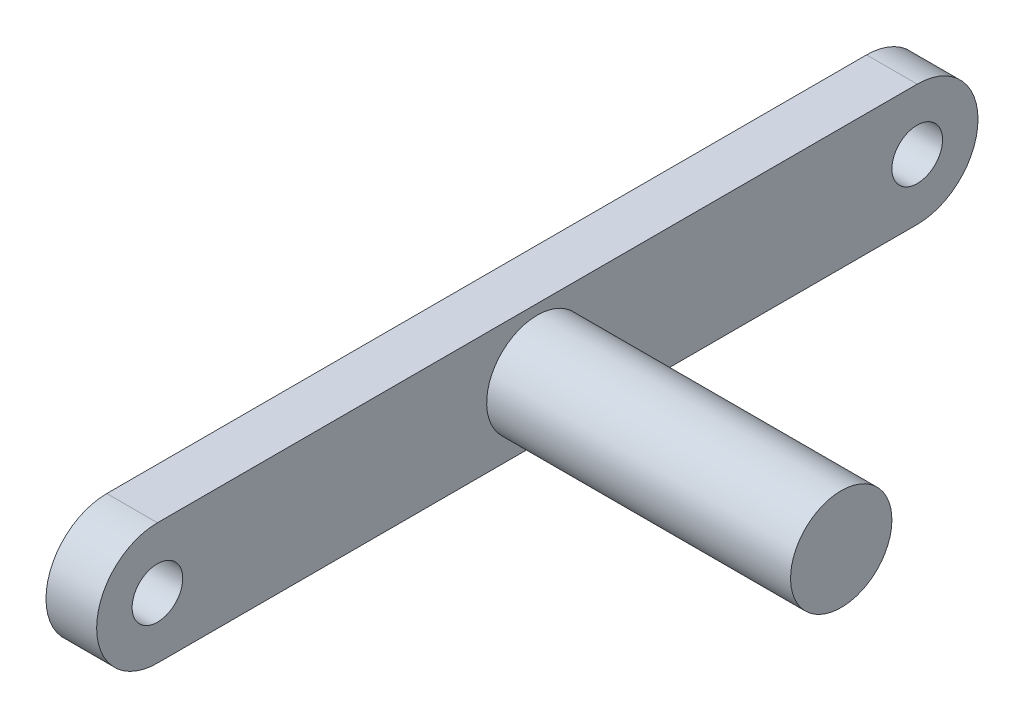
ISO-10303-21;
HEADER;
FILE_DESCRIPTION(('STEP AP214'),'2;1');
FILE_NAME('part.step','',(''),(''),'','','');
FILE_SCHEMA(('AUTOMOTIVE_DESIGN { 1 0 10303 214 1 1 1 1 }'));
ENDSEC;
DATA;
#1=APPLICATION_CONTEXT('core data for automotive mechanical design processes');
#2=APPLICATION_PROTOCOL_DEFINITION('international standard','automotive_design',2000,#1);
#3=PRODUCT_CONTEXT('',#1,'mechanical');
#4=PRODUCT('Part','Part','',(#3));
#5=PRODUCT_RELATED_PRODUCT_CATEGORY('part','',(#4));
#6=PRODUCT_DEFINITION_FORMATION('','',#4);
#7=PRODUCT_DEFINITION_CONTEXT('part definition',#1,'design');
#8=PRODUCT_DEFINITION('design','',#6,#7);
#9=PRODUCT_DEFINITION_SHAPE('','',#8);
#10=(LENGTH_UNIT() NAMED_UNIT(*) SI_UNIT(.MILLI.,.METRE.));
#11=(NAMED_UNIT(*) PLANE_ANGLE_UNIT() SI_UNIT($,.RADIAN.));
#12=(NAMED_UNIT(*) SI_UNIT($,.STERADIAN.) SOLID_ANGLE_UNIT());
#13=UNCERTAINTY_MEASURE_WITH_UNIT(LENGTH_MEASURE(1.E-05),#10,'distance_accuracy_value','');
#14=(GEOMETRIC_REPRESENTATION_CONTEXT(3) GLOBAL_UNCERTAINTY_ASSIGNED_CONTEXT((#13)) GLOBAL_UNIT_ASSIGNED_CONTEXT((#10,
#11,#12)) REPRESENTATION_CONTEXT('',''));
#15=CARTESIAN_POINT('',(0.,0.,0.));
#16=DIRECTION('',(0.,0.,1.));
#17=DIRECTION('',(1.,0.,0.));
#18=AXIS2_PLACEMENT_3D('',#15,#16,#17);
#19=CARTESIAN_POINT('',(30.,0.,0.));
#20=DIRECTION('',(1.,0.,0.));
#21=DIRECTION('',(0.,1.,0.));
#22=AXIS2_PLACEMENT_3D('',#19,#20,#21);
#23=CYLINDRICAL_SURFACE('',#22,5.);
#24=CARTESIAN_POINT('',(0.,0.,0.));
#25=DIRECTION('',(1.,0.,0.));
#26=DIRECTION('',(0.,0.,-1.));
#27=AXIS2_PLACEMENT_3D('',#24,#25,#26);
#28=CIRCLE('',#27,5.);
#29=CARTESIAN_POINT('',(0.,0.,-5.));
#30=VERTEX_POINT('',#29);
#31=EDGE_CURVE('E41',#30,#30,#28,.F.);
#32=ORIENTED_EDGE('',*,*,#31,.F.);
#33=EDGE_LOOP('',(#32));
#34=FACE_BOUND('',#33,.T.);
#35=CARTESIAN_POINT('',(30.,0.,0.));
#36=DIRECTION('',(1.,0.,0.));
#37=DIRECTION('',(0.,1.,0.));
#38=AXIS2_PLACEMENT_3D('',#35,#36,#37);
#39=CIRCLE('',#38,5.);
#40=CARTESIAN_POINT('',(30.,4.99999999999999,0.));
#41=VERTEX_POINT('',#40);
#42=EDGE_CURVE('E11',#41,#41,#39,.T.);
#43=ORIENTED_EDGE('',*,*,#42,.F.);
#44=EDGE_LOOP('',(#43));
#45=FACE_BOUND('',#44,.T.);
#46=ADVANCED_FACE('F33',(#34,#45),#23,.T.);
#47=CARTESIAN_POINT('',(30.,4.99999999999999,0.));
#48=DIRECTION('',(1.,0.,0.));
#49=DIRECTION('',(0.,1.,0.));
#50=AXIS2_PLACEMENT_3D('',#47,#48,#49);
#51=PLANE('',#50);
#52=ORIENTED_EDGE('',*,*,#42,.T.);
#53=EDGE_LOOP('',(#52));
#54=FACE_BOUND('',#53,.T.);
#55=ADVANCED_FACE('F120',(#54),#51,.T.);
#56=CARTESIAN_POINT('',(-5.,0.,37.5));
#57=DIRECTION('',(1.,0.,0.));
#58=DIRECTION('',(0.,0.,-1.));
#59=AXIS2_PLACEMENT_3D('',#56,#57,#58);
#60=CYLINDRICAL_SURFACE('',#59,6.);
#61=CARTESIAN_POINT('',(0.,0.,37.5));
#62=DIRECTION('',(1.,0.,0.));
#63=DIRECTION('',(0.,0.,-1.));
#64=AXIS2_PLACEMENT_3D('',#61,#62,#63);
#65=CIRCLE('',#64,6.);
#66=CARTESIAN_POINT('',(0.,6.,37.5));
#67=VERTEX_POINT('',#66);
#68=CARTESIAN_POINT('',(0.,-6.,37.5));
#69=VERTEX_POINT('',#68);
#70=EDGE_CURVE('E101',#67,#69,#65,.T.);
#71=ORIENTED_EDGE('',*,*,#70,.F.);
#72=DIRECTION('',(1.,0.,0.));
#73=VECTOR('',#72,1.);
#74=CARTESIAN_POINT('',(-5.,6.,37.5));
#75=LINE('',#74,#73);
#76=CARTESIAN_POINT('',(-5.,6.,37.5));
#77=VERTEX_POINT('',#76);
#78=EDGE_CURVE('E49',#77,#67,#75,.T.);
#79=ORIENTED_EDGE('',*,*,#78,.F.);
#80=CARTESIAN_POINT('',(-5.,0.,37.5));
#81=DIRECTION('',(1.,0.,0.));
#82=DIRECTION('',(0.,0.,-1.));
#83=AXIS2_PLACEMENT_3D('',#80,#81,#82);
#84=CIRCLE('',#83,6.);
#85=CARTESIAN_POINT('',(-5.,-6.,37.5));
#86=VERTEX_POINT('',#85);
#87=EDGE_CURVE('E94',#77,#86,#84,.T.);
#88=ORIENTED_EDGE('',*,*,#87,.T.);
#89=DIRECTION('',(1.,0.,0.));
#90=VECTOR('',#89,1.);
#91=CARTESIAN_POINT('',(-5.,-6.,37.5));
#92=LINE('',#91,#90);
#93=EDGE_CURVE('E77',#86,#69,#92,.T.);
#94=ORIENTED_EDGE('',*,*,#93,.T.);
#95=EDGE_LOOP('',(#71,#79,#88,#94));
#96=FACE_BOUND('',#95,.T.);
#97=ADVANCED_FACE('F124',(#96),#60,.T.);
#98=CARTESIAN_POINT('',(-5.,6.,37.5));
#99=DIRECTION('',(0.,1.,0.));
#100=DIRECTION('',(0.,0.,1.));
#101=AXIS2_PLACEMENT_3D('',#98,#99,#100);
#102=PLANE('',#101);
#103=DIRECTION('',(0.,0.,1.));
#104=VECTOR('',#103,1.);
#105=CARTESIAN_POINT('',(0.,6.,37.5));
#106=LINE('',#105,#104);
#107=CARTESIAN_POINT('',(0.,6.00000000000002,-37.5));
#108=VERTEX_POINT('',#107);
#109=EDGE_CURVE('E96',#108,#67,#106,.T.);
#110=ORIENTED_EDGE('',*,*,#109,.F.);
#111=DIRECTION('',(1.,0.,0.));
#112=VECTOR('',#111,1.);
#113=CARTESIAN_POINT('',(-5.,6.00000000000002,-37.5));
#114=LINE('',#113,#112);
#115=CARTESIAN_POINT('',(-5.,6.00000000000002,-37.5));
#116=VERTEX_POINT('',#115);
#117=EDGE_CURVE('E66',#116,#108,#114,.T.);
#118=ORIENTED_EDGE('',*,*,#117,.F.);
#119=DIRECTION('',(0.,0.,1.));
#120=VECTOR('',#119,1.);
#121=CARTESIAN_POINT('',(-5.,6.,37.5));
#122=LINE('',#121,#120);
#123=EDGE_CURVE('E91',#116,#77,#122,.T.);
#124=ORIENTED_EDGE('',*,*,#123,.T.);
#125=ORIENTED_EDGE('',*,*,#78,.T.);
#126=EDGE_LOOP('',(#110,#118,#124,#125));
#127=FACE_BOUND('',#126,.T.);
#128=ADVANCED_FACE('F128',(#127),#102,.T.);
#129=CARTESIAN_POINT('',(-5.,0.,-37.5));
#130=DIRECTION('',(1.,0.,0.));
#131=DIRECTION('',(0.,0.,-1.));
#132=AXIS2_PLACEMENT_3D('',#129,#130,#131);
#133=CYLINDRICAL_SURFACE('',#132,6.);
#134=CARTESIAN_POINT('',(0.,0.,-37.5));
#135=DIRECTION('',(1.,0.,0.));
#136=DIRECTION('',(0.,0.,-1.));
#137=AXIS2_PLACEMENT_3D('',#134,#135,#136);
#138=CIRCLE('',#137,6.);
#139=CARTESIAN_POINT('',(0.,-5.99999999999999,-37.5));
#140=VERTEX_POINT('',#139);
#141=EDGE_CURVE('E85',#140,#108,#138,.T.);
#142=ORIENTED_EDGE('',*,*,#141,.F.);
#143=DIRECTION('',(1.,0.,0.));
#144=VECTOR('',#143,1.);
#145=CARTESIAN_POINT('',(-5.,-5.99999999999999,-37.5));
#146=LINE('',#145,#144);
#147=CARTESIAN_POINT('',(-5.,-5.99999999999999,-37.5));
#148=VERTEX_POINT('',#147);
#149=EDGE_CURVE('E80',#148,#140,#146,.T.);
#150=ORIENTED_EDGE('',*,*,#149,.F.);
#151=CARTESIAN_POINT('',(-5.,0.,-37.5));
#152=DIRECTION('',(1.,0.,0.));
#153=DIRECTION('',(0.,0.,-1.));
#154=AXIS2_PLACEMENT_3D('',#151,#152,#153);
#155=CIRCLE('',#154,6.);
#156=EDGE_CURVE('E83',#148,#116,#155,.T.);
#157=ORIENTED_EDGE('',*,*,#156,.T.);
#158=ORIENTED_EDGE('',*,*,#117,.T.);
#159=EDGE_LOOP('',(#142,#150,#157,#158));
#160=FACE_BOUND('',#159,.T.);
#161=ADVANCED_FACE('F82',(#160),#133,.T.);
#162=CARTESIAN_POINT('',(-5.,-6.,37.5));
#163=DIRECTION('',(0.,-1.,0.));
#164=DIRECTION('',(0.,0.,-1.));
#165=AXIS2_PLACEMENT_3D('',#162,#163,#164);
#166=PLANE('',#165);
#167=DIRECTION('',(0.,0.,-1.));
#168=VECTOR('',#167,1.);
#169=CARTESIAN_POINT('',(0.,-6.,37.5));
#170=LINE('',#169,#168);
#171=EDGE_CURVE('E104',#69,#140,#170,.T.);
#172=ORIENTED_EDGE('',*,*,#171,.F.);
#173=ORIENTED_EDGE('',*,*,#93,.F.);
#174=DIRECTION('',(0.,0.,-1.));
#175=VECTOR('',#174,1.);
#176=CARTESIAN_POINT('',(-5.,-6.,37.5));
#177=LINE('',#176,#175);
#178=EDGE_CURVE('E90',#86,#148,#177,.T.);
#179=ORIENTED_EDGE('',*,*,#178,.T.);
#180=ORIENTED_EDGE('',*,*,#149,.T.);
#181=EDGE_LOOP('',(#172,#173,#179,#180));
#182=FACE_BOUND('',#181,.T.);
#183=ADVANCED_FACE('F93',(#182),#166,.T.);
#184=CARTESIAN_POINT('',(-5.,0.,37.5));
#185=DIRECTION('',(1.,0.,0.));
#186=DIRECTION('',(0.,0.,-1.));
#187=AXIS2_PLACEMENT_3D('',#184,#185,#186);
#188=PLANE('',#187);
#189=CARTESIAN_POINT('',(-5.,0.,-37.5));
#190=DIRECTION('',(1.,0.,0.));
#191=DIRECTION('',(0.,0.,-1.));
#192=AXIS2_PLACEMENT_3D('',#189,#190,#191);
#193=CIRCLE('',#192,2.5);
#194=CARTESIAN_POINT('',(-5.,0.,-40.));
#195=VERTEX_POINT('',#194);
#196=EDGE_CURVE('E154',#195,#195,#193,.T.);
#197=ORIENTED_EDGE('',*,*,#196,.T.);
#198=EDGE_LOOP('',(#197));
#199=FACE_BOUND('',#198,.T.);
#200=CARTESIAN_POINT('',(-5.,0.,37.5));
#201=DIRECTION('',(1.,0.,0.));
#202=DIRECTION('',(0.,0.,-1.));
#203=AXIS2_PLACEMENT_3D('',#200,#201,#202);
#204=CIRCLE('',#203,2.5);
#205=CARTESIAN_POINT('',(-5.,0.,35.));
#206=VERTEX_POINT('',#205);
#207=EDGE_CURVE('E105',#206,#206,#204,.T.);
#208=ORIENTED_EDGE('',*,*,#207,.T.);
#209=EDGE_LOOP('',(#208));
#210=FACE_BOUND('',#209,.T.);
#211=ORIENTED_EDGE('',*,*,#87,.F.);
#212=ORIENTED_EDGE('',*,*,#123,.F.);
#213=ORIENTED_EDGE('',*,*,#156,.F.);
#214=ORIENTED_EDGE('',*,*,#178,.F.);
#215=EDGE_LOOP('',(#211,#212,#213,#214));
#216=FACE_BOUND('',#215,.T.);
#217=ADVANCED_FACE('F89',(#199,#210,#216),#188,.F.);
#218=CARTESIAN_POINT('',(0.,0.,37.5));
#219=DIRECTION('',(1.,0.,0.));
#220=DIRECTION('',(0.,0.,-1.));
#221=AXIS2_PLACEMENT_3D('',#218,#219,#220);
#222=PLANE('',#221);
#223=ORIENTED_EDGE('',*,*,#31,.T.);
#224=EDGE_LOOP('',(#223));
#225=FACE_BOUND('',#224,.T.);
#226=CARTESIAN_POINT('',(0.,0.,-37.5));
#227=DIRECTION('',(1.,0.,0.));
#228=DIRECTION('',(0.,0.,-1.));
#229=AXIS2_PLACEMENT_3D('',#226,#227,#228);
#230=CIRCLE('',#229,2.5);
#231=CARTESIAN_POINT('',(0.,0.,-40.));
#232=VERTEX_POINT('',#231);
#233=EDGE_CURVE('E157',#232,#232,#230,.T.);
#234=ORIENTED_EDGE('',*,*,#233,.F.);
#235=EDGE_LOOP('',(#234));
#236=FACE_BOUND('',#235,.T.);
#237=CARTESIAN_POINT('',(0.,0.,37.5));
#238=DIRECTION('',(1.,0.,0.));
#239=DIRECTION('',(0.,0.,-1.));
#240=AXIS2_PLACEMENT_3D('',#237,#238,#239);
#241=CIRCLE('',#240,2.5);
#242=CARTESIAN_POINT('',(0.,0.,35.));
#243=VERTEX_POINT('',#242);
#244=EDGE_CURVE('E159',#243,#243,#241,.T.);
#245=ORIENTED_EDGE('',*,*,#244,.F.);
#246=EDGE_LOOP('',(#245));
#247=FACE_BOUND('',#246,.T.);
#248=ORIENTED_EDGE('',*,*,#70,.T.);
#249=ORIENTED_EDGE('',*,*,#171,.T.);
#250=ORIENTED_EDGE('',*,*,#141,.T.);
#251=ORIENTED_EDGE('',*,*,#109,.T.);
#252=EDGE_LOOP('',(#248,#249,#250,#251));
#253=FACE_BOUND('',#252,.T.);
#254=ADVANCED_FACE('F115',(#225,#236,#247,#253),#222,.T.);
#255=CARTESIAN_POINT('',(-5.,0.,37.5));
#256=DIRECTION('',(1.,0.,0.));
#257=DIRECTION('',(0.,0.,-1.));
#258=AXIS2_PLACEMENT_3D('',#255,#256,#257);
#259=CYLINDRICAL_SURFACE('',#258,2.5);
#260=ORIENTED_EDGE('',*,*,#207,.F.);
#261=EDGE_LOOP('',(#260));
#262=FACE_BOUND('',#261,.T.);
#263=ORIENTED_EDGE('',*,*,#244,.T.);
#264=EDGE_LOOP('',(#263));
#265=FACE_BOUND('',#264,.T.);
#266=ADVANCED_FACE('F139',(#262,#265),#259,.F.);
#267=CARTESIAN_POINT('',(-5.,0.,-37.5));
#268=DIRECTION('',(1.,0.,0.));
#269=DIRECTION('',(0.,0.,-1.));
#270=AXIS2_PLACEMENT_3D('',#267,#268,#269);
#271=CYLINDRICAL_SURFACE('',#270,2.5);
#272=ORIENTED_EDGE('',*,*,#196,.F.);
#273=EDGE_LOOP('',(#272));
#274=FACE_BOUND('',#273,.T.);
#275=ORIENTED_EDGE('',*,*,#233,.T.);
#276=EDGE_LOOP('',(#275));
#277=FACE_BOUND('',#276,.T.);
#278=ADVANCED_FACE('F145',(#274,#277),#271,.F.);
#279=CLOSED_SHELL('',(#46,#55,#97,#128,#161,#183,#217,#254,#266,#278));
#280=MANIFOLD_SOLID_BREP('B2',#279);
#281=ADVANCED_BREP_SHAPE_REPRESENTATION('',(#18,#280),#14);
#282=SHAPE_DEFINITION_REPRESENTATION(#9,#281);
ENDSEC;
END-ISO-10303-21;
